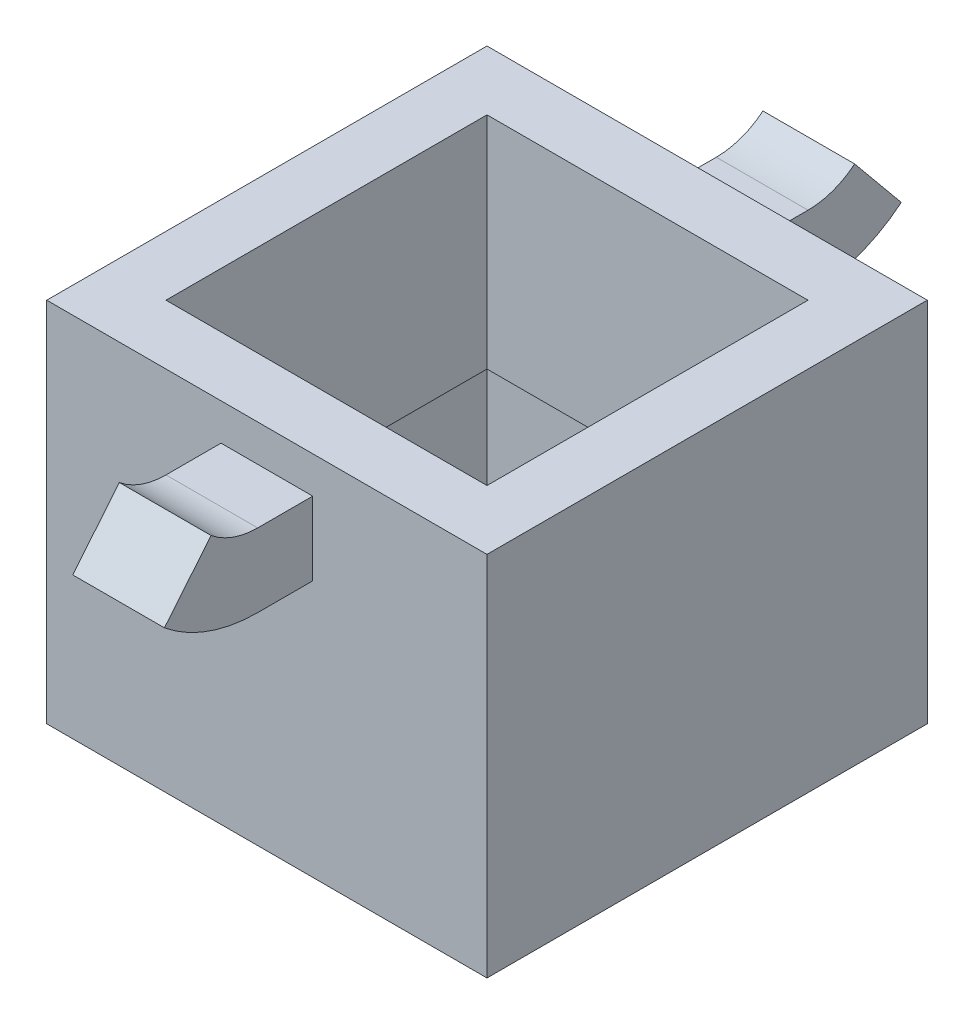
ISO-10303-21;
HEADER;
FILE_DESCRIPTION(('STEP AP214'),'2;1');
FILE_NAME('part.step','',(''),(''),'','','');
FILE_SCHEMA(('AUTOMOTIVE_DESIGN { 1 0 10303 214 1 1 1 1 }'));
ENDSEC;
DATA;
#1=APPLICATION_CONTEXT('core data for automotive mechanical design processes');
#2=APPLICATION_PROTOCOL_DEFINITION('international standard','automotive_design',2000,#1);
#3=PRODUCT_CONTEXT('',#1,'mechanical');
#4=PRODUCT('Part','Part','',(#3));
#5=PRODUCT_RELATED_PRODUCT_CATEGORY('part','',(#4));
#6=PRODUCT_DEFINITION_FORMATION('','',#4);
#7=PRODUCT_DEFINITION_CONTEXT('part definition',#1,'design');
#8=PRODUCT_DEFINITION('design','',#6,#7);
#9=PRODUCT_DEFINITION_SHAPE('','',#8);
#10=(LENGTH_UNIT() NAMED_UNIT(*) SI_UNIT(.MILLI.,.METRE.));
#11=(NAMED_UNIT(*) PLANE_ANGLE_UNIT() SI_UNIT($,.RADIAN.));
#12=(NAMED_UNIT(*) SI_UNIT($,.STERADIAN.) SOLID_ANGLE_UNIT());
#13=UNCERTAINTY_MEASURE_WITH_UNIT(LENGTH_MEASURE(1.E-05),#10,'distance_accuracy_value','');
#14=(GEOMETRIC_REPRESENTATION_CONTEXT(3) GLOBAL_UNCERTAINTY_ASSIGNED_CONTEXT((#13)) GLOBAL_UNIT_ASSIGNED_CONTEXT((#10,
#11,#12)) REPRESENTATION_CONTEXT('',''));
#15=CARTESIAN_POINT('',(0.,0.,0.));
#16=DIRECTION('',(0.,0.,1.));
#17=DIRECTION('',(1.,0.,0.));
#18=AXIS2_PLACEMENT_3D('',#15,#16,#17);
#19=CARTESIAN_POINT('',(12.,20.,-12.));
#20=DIRECTION('',(0.,0.,1.));
#21=DIRECTION('',(1.,0.,0.));
#22=AXIS2_PLACEMENT_3D('',#19,#20,#21);
#23=PLANE('',#22);
#24=DIRECTION('',(-1.,0.,0.));
#25=VECTOR('',#24,1.);
#26=CARTESIAN_POINT('',(12.,0.,-12.));
#27=LINE('',#26,#25);
#28=CARTESIAN_POINT('',(12.,0.,-12.));
#29=VERTEX_POINT('',#28);
#30=CARTESIAN_POINT('',(-12.,0.,-12.));
#31=VERTEX_POINT('',#30);
#32=EDGE_CURVE('E365',#29,#31,#27,.T.);
#33=ORIENTED_EDGE('',*,*,#32,.T.);
#34=DIRECTION('',(0.,-1.,0.));
#35=VECTOR('',#34,1.);
#36=CARTESIAN_POINT('',(-12.,20.,-12.));
#37=LINE('',#36,#35);
#38=CARTESIAN_POINT('',(-12.,20.,-12.));
#39=VERTEX_POINT('',#38);
#40=EDGE_CURVE('E371',#39,#31,#37,.T.);
#41=ORIENTED_EDGE('',*,*,#40,.F.);
#42=DIRECTION('',(-1.,0.,0.));
#43=VECTOR('',#42,1.);
#44=CARTESIAN_POINT('',(12.,20.,-12.));
#45=LINE('',#44,#43);
#46=CARTESIAN_POINT('',(12.,20.,-12.));
#47=VERTEX_POINT('',#46);
#48=EDGE_CURVE('E369',#47,#39,#45,.T.);
#49=ORIENTED_EDGE('',*,*,#48,.F.);
#50=DIRECTION('',(0.,-1.,0.));
#51=VECTOR('',#50,1.);
#52=CARTESIAN_POINT('',(12.,20.,-12.));
#53=LINE('',#52,#51);
#54=EDGE_CURVE('E381',#47,#29,#53,.T.);
#55=ORIENTED_EDGE('',*,*,#54,.T.);
#56=EDGE_LOOP('',(#33,#41,#49,#55));
#57=FACE_BOUND('',#56,.T.);
#58=DIRECTION('',(0.,-1.,0.));
#59=VECTOR('',#58,1.);
#60=CARTESIAN_POINT('',(2.50000000000001,18.,-12.));
#61=LINE('',#60,#59);
#62=CARTESIAN_POINT('',(2.50000000000001,18.,-12.));
#63=VERTEX_POINT('',#62);
#64=CARTESIAN_POINT('',(2.50000000000001,14.,-12.));
#65=VERTEX_POINT('',#64);
#66=EDGE_CURVE('E306',#63,#65,#61,.T.);
#67=ORIENTED_EDGE('',*,*,#66,.F.);
#68=DIRECTION('',(1.,0.,0.));
#69=VECTOR('',#68,1.);
#70=CARTESIAN_POINT('',(-2.49999999999999,18.,-12.));
#71=LINE('',#70,#69);
#72=CARTESIAN_POINT('',(-2.5,18.,-12.));
#73=VERTEX_POINT('',#72);
#74=EDGE_CURVE('E311',#73,#63,#71,.T.);
#75=ORIENTED_EDGE('',*,*,#74,.F.);
#76=DIRECTION('',(0.,1.,0.));
#77=VECTOR('',#76,1.);
#78=CARTESIAN_POINT('',(-2.49999999999999,18.,-12.));
#79=LINE('',#78,#77);
#80=CARTESIAN_POINT('',(-2.5,14.,-12.));
#81=VERTEX_POINT('',#80);
#82=EDGE_CURVE('E320',#81,#73,#79,.T.);
#83=ORIENTED_EDGE('',*,*,#82,.F.);
#84=DIRECTION('',(-1.,0.,0.));
#85=VECTOR('',#84,1.);
#86=CARTESIAN_POINT('',(-2.49999999999999,14.,-12.));
#87=LINE('',#86,#85);
#88=EDGE_CURVE('E317',#65,#81,#87,.T.);
#89=ORIENTED_EDGE('',*,*,#88,.F.);
#90=EDGE_LOOP('',(#67,#75,#83,#89));
#91=FACE_BOUND('',#90,.T.);
#92=ADVANCED_FACE('F32',(#57,#91),#23,.F.);
#93=CARTESIAN_POINT('',(-12.,20.,12.));
#94=DIRECTION('',(1.,0.,0.));
#95=DIRECTION('',(0.,0.,-1.));
#96=AXIS2_PLACEMENT_3D('',#93,#94,#95);
#97=PLANE('',#96);
#98=DIRECTION('',(0.,0.,1.));
#99=VECTOR('',#98,1.);
#100=CARTESIAN_POINT('',(-12.,0.,12.));
#101=LINE('',#100,#99);
#102=CARTESIAN_POINT('',(-12.,0.,12.));
#103=VERTEX_POINT('',#102);
#104=EDGE_CURVE('E360',#31,#103,#101,.T.);
#105=ORIENTED_EDGE('',*,*,#104,.T.);
#106=DIRECTION('',(0.,-1.,0.));
#107=VECTOR('',#106,1.);
#108=CARTESIAN_POINT('',(-12.,20.,12.));
#109=LINE('',#108,#107);
#110=CARTESIAN_POINT('',(-12.,20.,12.));
#111=VERTEX_POINT('',#110);
#112=EDGE_CURVE('E11',#111,#103,#109,.T.);
#113=ORIENTED_EDGE('',*,*,#112,.F.);
#114=DIRECTION('',(0.,0.,1.));
#115=VECTOR('',#114,1.);
#116=CARTESIAN_POINT('',(-12.,20.,12.));
#117=LINE('',#116,#115);
#118=EDGE_CURVE('E361',#39,#111,#117,.T.);
#119=ORIENTED_EDGE('',*,*,#118,.F.);
#120=ORIENTED_EDGE('',*,*,#40,.T.);
#121=EDGE_LOOP('',(#105,#113,#119,#120));
#122=FACE_BOUND('',#121,.T.);
#123=ADVANCED_FACE('F34',(#122),#97,.F.);
#124=CARTESIAN_POINT('',(12.,20.,12.));
#125=DIRECTION('',(0.,0.,-1.));
#126=DIRECTION('',(-1.,0.,0.));
#127=AXIS2_PLACEMENT_3D('',#124,#125,#126);
#128=PLANE('',#127);
#129=DIRECTION('',(1.,0.,0.));
#130=VECTOR('',#129,1.);
#131=CARTESIAN_POINT('',(-2.49999999999999,18.,12.));
#132=LINE('',#131,#130);
#133=CARTESIAN_POINT('',(-2.49999999999999,18.,12.));
#134=VERTEX_POINT('',#133);
#135=CARTESIAN_POINT('',(2.50000000000001,18.,12.));
#136=VERTEX_POINT('',#135);
#137=EDGE_CURVE('E270',#134,#136,#132,.T.);
#138=ORIENTED_EDGE('',*,*,#137,.T.);
#139=DIRECTION('',(0.,-1.,0.));
#140=VECTOR('',#139,1.);
#141=CARTESIAN_POINT('',(2.50000000000001,18.,12.));
#142=LINE('',#141,#140);
#143=CARTESIAN_POINT('',(2.5,14.,12.));
#144=VERTEX_POINT('',#143);
#145=EDGE_CURVE('E253',#136,#144,#142,.T.);
#146=ORIENTED_EDGE('',*,*,#145,.T.);
#147=DIRECTION('',(-1.,0.,0.));
#148=VECTOR('',#147,1.);
#149=CARTESIAN_POINT('',(-2.49999999999999,14.,12.));
#150=LINE('',#149,#148);
#151=CARTESIAN_POINT('',(-2.5,14.,12.));
#152=VERTEX_POINT('',#151);
#153=EDGE_CURVE('E264',#144,#152,#150,.T.);
#154=ORIENTED_EDGE('',*,*,#153,.T.);
#155=DIRECTION('',(0.,1.,0.));
#156=VECTOR('',#155,1.);
#157=CARTESIAN_POINT('',(-2.49999999999999,18.,12.));
#158=LINE('',#157,#156);
#159=EDGE_CURVE('E273',#152,#134,#158,.T.);
#160=ORIENTED_EDGE('',*,*,#159,.T.);
#161=EDGE_LOOP('',(#138,#146,#154,#160));
#162=FACE_BOUND('',#161,.T.);
#163=DIRECTION('',(1.,0.,0.));
#164=VECTOR('',#163,1.);
#165=CARTESIAN_POINT('',(12.,0.,12.));
#166=LINE('',#165,#164);
#167=CARTESIAN_POINT('',(12.,0.,12.));
#168=VERTEX_POINT('',#167);
#169=EDGE_CURVE('E374',#103,#168,#166,.T.);
#170=ORIENTED_EDGE('',*,*,#169,.T.);
#171=DIRECTION('',(0.,-1.,0.));
#172=VECTOR('',#171,1.);
#173=CARTESIAN_POINT('',(12.,20.,12.));
#174=LINE('',#173,#172);
#175=CARTESIAN_POINT('',(12.,20.,12.));
#176=VERTEX_POINT('',#175);
#177=EDGE_CURVE('E40',#176,#168,#174,.T.);
#178=ORIENTED_EDGE('',*,*,#177,.F.);
#179=DIRECTION('',(1.,0.,0.));
#180=VECTOR('',#179,1.);
#181=CARTESIAN_POINT('',(12.,20.,12.));
#182=LINE('',#181,#180);
#183=EDGE_CURVE('E364',#111,#176,#182,.T.);
#184=ORIENTED_EDGE('',*,*,#183,.F.);
#185=ORIENTED_EDGE('',*,*,#112,.T.);
#186=EDGE_LOOP('',(#170,#178,#184,#185));
#187=FACE_BOUND('',#186,.T.);
#188=ADVANCED_FACE('F402',(#162,#187),#128,.F.);
#189=CARTESIAN_POINT('',(12.,20.,12.));
#190=DIRECTION('',(-1.,0.,0.));
#191=DIRECTION('',(0.,0.,1.));
#192=AXIS2_PLACEMENT_3D('',#189,#190,#191);
#193=PLANE('',#192);
#194=DIRECTION('',(0.,0.,-1.));
#195=VECTOR('',#194,1.);
#196=CARTESIAN_POINT('',(12.,0.,12.));
#197=LINE('',#196,#195);
#198=EDGE_CURVE('E376',#168,#29,#197,.T.);
#199=ORIENTED_EDGE('',*,*,#198,.T.);
#200=ORIENTED_EDGE('',*,*,#54,.F.);
#201=DIRECTION('',(0.,0.,-1.));
#202=VECTOR('',#201,1.);
#203=CARTESIAN_POINT('',(12.,20.,12.));
#204=LINE('',#203,#202);
#205=EDGE_CURVE('E367',#176,#47,#204,.T.);
#206=ORIENTED_EDGE('',*,*,#205,.F.);
#207=ORIENTED_EDGE('',*,*,#177,.T.);
#208=EDGE_LOOP('',(#199,#200,#206,#207));
#209=FACE_BOUND('',#208,.T.);
#210=ADVANCED_FACE('F388',(#209),#193,.F.);
#211=CARTESIAN_POINT('',(0.,20.,0.));
#212=DIRECTION('',(0.,1.,0.));
#213=DIRECTION('',(0.,0.,1.));
#214=AXIS2_PLACEMENT_3D('',#211,#212,#213);
#215=PLANE('',#214);
#216=DIRECTION('',(0.,0.,-1.));
#217=VECTOR('',#216,1.);
#218=CARTESIAN_POINT('',(-8.75,20.,-8.75));
#219=LINE('',#218,#217);
#220=CARTESIAN_POINT('',(-8.75,20.,8.75));
#221=VERTEX_POINT('',#220);
#222=CARTESIAN_POINT('',(-8.75,20.,-8.75));
#223=VERTEX_POINT('',#222);
#224=EDGE_CURVE('E203',#221,#223,#219,.T.);
#225=ORIENTED_EDGE('',*,*,#224,.T.);
#226=DIRECTION('',(1.,0.,0.));
#227=VECTOR('',#226,1.);
#228=CARTESIAN_POINT('',(8.75,20.,-8.75));
#229=LINE('',#228,#227);
#230=CARTESIAN_POINT('',(8.75,20.,-8.75));
#231=VERTEX_POINT('',#230);
#232=EDGE_CURVE('E192',#223,#231,#229,.T.);
#233=ORIENTED_EDGE('',*,*,#232,.T.);
#234=DIRECTION('',(0.,0.,1.));
#235=VECTOR('',#234,1.);
#236=CARTESIAN_POINT('',(8.75,20.,-8.75));
#237=LINE('',#236,#235);
#238=CARTESIAN_POINT('',(8.75,20.,8.75));
#239=VERTEX_POINT('',#238);
#240=EDGE_CURVE('E214',#231,#239,#237,.T.);
#241=ORIENTED_EDGE('',*,*,#240,.T.);
#242=DIRECTION('',(-1.,0.,0.));
#243=VECTOR('',#242,1.);
#244=CARTESIAN_POINT('',(8.75,20.,8.75));
#245=LINE('',#244,#243);
#246=EDGE_CURVE('E210',#239,#221,#245,.T.);
#247=ORIENTED_EDGE('',*,*,#246,.T.);
#248=EDGE_LOOP('',(#225,#233,#241,#247));
#249=FACE_BOUND('',#248,.T.);
#250=ORIENTED_EDGE('',*,*,#118,.T.);
#251=ORIENTED_EDGE('',*,*,#183,.T.);
#252=ORIENTED_EDGE('',*,*,#205,.T.);
#253=ORIENTED_EDGE('',*,*,#48,.T.);
#254=EDGE_LOOP('',(#250,#251,#252,#253));
#255=FACE_BOUND('',#254,.T.);
#256=ADVANCED_FACE('F208',(#249,#255),#215,.T.);
#257=CARTESIAN_POINT('',(0.,0.,0.));
#258=DIRECTION('',(0.,1.,0.));
#259=DIRECTION('',(0.,0.,1.));
#260=AXIS2_PLACEMENT_3D('',#257,#258,#259);
#261=PLANE('',#260);
#262=DIRECTION('',(-1.,0.,0.));
#263=VECTOR('',#262,1.);
#264=CARTESIAN_POINT('',(-10.,0.,10.));
#265=LINE('',#264,#263);
#266=CARTESIAN_POINT('',(10.,0.,10.));
#267=VERTEX_POINT('',#266);
#268=CARTESIAN_POINT('',(-10.,0.,10.));
#269=VERTEX_POINT('',#268);
#270=EDGE_CURVE('E241',#267,#269,#265,.T.);
#271=ORIENTED_EDGE('',*,*,#270,.F.);
#272=DIRECTION('',(0.,0.,1.));
#273=VECTOR('',#272,1.);
#274=CARTESIAN_POINT('',(10.,0.,-10.));
#275=LINE('',#274,#273);
#276=CARTESIAN_POINT('',(10.,0.,-10.));
#277=VERTEX_POINT('',#276);
#278=EDGE_CURVE('E239',#277,#267,#275,.T.);
#279=ORIENTED_EDGE('',*,*,#278,.F.);
#280=DIRECTION('',(1.,0.,0.));
#281=VECTOR('',#280,1.);
#282=CARTESIAN_POINT('',(-10.,0.,-10.));
#283=LINE('',#282,#281);
#284=CARTESIAN_POINT('',(-10.,0.,-10.));
#285=VERTEX_POINT('',#284);
#286=EDGE_CURVE('E247',#285,#277,#283,.T.);
#287=ORIENTED_EDGE('',*,*,#286,.F.);
#288=DIRECTION('',(0.,0.,-1.));
#289=VECTOR('',#288,1.);
#290=CARTESIAN_POINT('',(-10.,0.,-10.));
#291=LINE('',#290,#289);
#292=EDGE_CURVE('E244',#269,#285,#291,.T.);
#293=ORIENTED_EDGE('',*,*,#292,.F.);
#294=EDGE_LOOP('',(#271,#279,#287,#293));
#295=FACE_BOUND('',#294,.T.);
#296=ORIENTED_EDGE('',*,*,#104,.F.);
#297=ORIENTED_EDGE('',*,*,#32,.F.);
#298=ORIENTED_EDGE('',*,*,#198,.F.);
#299=ORIENTED_EDGE('',*,*,#169,.F.);
#300=EDGE_LOOP('',(#296,#297,#298,#299));
#301=FACE_BOUND('',#300,.T.);
#302=ADVANCED_FACE('F394',(#295,#301),#261,.F.);
#303=CARTESIAN_POINT('',(0.,22.,-15.));
#304=DIRECTION('',(1.,0.,0.));
#305=DIRECTION('',(0.,0.,-1.));
#306=AXIS2_PLACEMENT_3D('',#303,#304,#305);
#307=CYLINDRICAL_SURFACE('',#306,8.);
#308=DIRECTION('',(-1.,0.,0.));
#309=VECTOR('',#308,1.);
#310=CARTESIAN_POINT('',(-2.49999999999999,14.,-15.));
#311=LINE('',#310,#309);
#312=CARTESIAN_POINT('',(2.5,14.,-15.));
#313=VERTEX_POINT('',#312);
#314=CARTESIAN_POINT('',(-2.49999999999999,14.,-15.));
#315=VERTEX_POINT('',#314);
#316=EDGE_CURVE('E307',#313,#315,#311,.T.);
#317=ORIENTED_EDGE('',*,*,#316,.T.);
#318=CARTESIAN_POINT('',(-2.49999999999999,22.,-15.));
#319=DIRECTION('',(1.,0.,0.));
#320=DIRECTION('',(0.,0.,-1.));
#321=AXIS2_PLACEMENT_3D('',#318,#319,#320);
#322=CIRCLE('',#321,8.);
#323=CARTESIAN_POINT('',(-2.49999999999999,15.8236304445881,-20.0845313564753));
#324=VERTEX_POINT('',#323);
#325=EDGE_CURVE('E354',#315,#324,#322,.T.);
#326=ORIENTED_EDGE('',*,*,#325,.T.);
#327=DIRECTION('',(-1.,0.,0.));
#328=VECTOR('',#327,1.);
#329=CARTESIAN_POINT('',(-2.49999999999999,15.8236304445881,-20.0845313564753));
#330=LINE('',#329,#328);
#331=CARTESIAN_POINT('',(2.5,15.8236304445881,-20.0845313564753));
#332=VERTEX_POINT('',#331);
#333=EDGE_CURVE('E345',#332,#324,#330,.T.);
#334=ORIENTED_EDGE('',*,*,#333,.F.);
#335=CARTESIAN_POINT('',(2.5,22.,-15.));
#336=DIRECTION('',(1.,0.,0.));
#337=DIRECTION('',(0.,0.,-1.));
#338=AXIS2_PLACEMENT_3D('',#335,#336,#337);
#339=CIRCLE('',#338,8.);
#340=EDGE_CURVE('E357',#313,#332,#339,.T.);
#341=ORIENTED_EDGE('',*,*,#340,.F.);
#342=EDGE_LOOP('',(#317,#326,#334,#341));
#343=FACE_BOUND('',#342,.T.);
#344=ADVANCED_FACE('F417',(#343),#307,.T.);
#345=CARTESIAN_POINT('',(0.,22.,-15.));
#346=DIRECTION('',(1.,0.,0.));
#347=DIRECTION('',(0.,0.,-1.));
#348=AXIS2_PLACEMENT_3D('',#345,#346,#347);
#349=CYLINDRICAL_SURFACE('',#348,4.);
#350=DIRECTION('',(1.,0.,0.));
#351=VECTOR('',#350,1.);
#352=CARTESIAN_POINT('',(-2.49999999999999,18.,-15.));
#353=LINE('',#352,#351);
#354=CARTESIAN_POINT('',(-2.49999999999999,18.,-15.));
#355=VERTEX_POINT('',#354);
#356=CARTESIAN_POINT('',(2.50000000000001,18.,-15.));
#357=VERTEX_POINT('',#356);
#358=EDGE_CURVE('E310',#355,#357,#353,.T.);
#359=ORIENTED_EDGE('',*,*,#358,.T.);
#360=CARTESIAN_POINT('',(2.50000000000001,22.,-15.));
#361=DIRECTION('',(1.,0.,0.));
#362=DIRECTION('',(0.,0.,-1.));
#363=AXIS2_PLACEMENT_3D('',#360,#361,#362);
#364=CIRCLE('',#363,4.);
#365=CARTESIAN_POINT('',(2.50000000000001,18.911815222294,-17.5422656782377));
#366=VERTEX_POINT('',#365);
#367=EDGE_CURVE('E348',#357,#366,#364,.T.);
#368=ORIENTED_EDGE('',*,*,#367,.T.);
#369=DIRECTION('',(1.,0.,0.));
#370=VECTOR('',#369,1.);
#371=CARTESIAN_POINT('',(-2.49999999999999,18.911815222294,-17.5422656782377));
#372=LINE('',#371,#370);
#373=CARTESIAN_POINT('',(-2.49999999999999,18.911815222294,-17.5422656782377));
#374=VERTEX_POINT('',#373);
#375=EDGE_CURVE('E339',#374,#366,#372,.T.);
#376=ORIENTED_EDGE('',*,*,#375,.F.);
#377=CARTESIAN_POINT('',(-2.49999999999999,22.,-15.));
#378=DIRECTION('',(1.,0.,0.));
#379=DIRECTION('',(0.,0.,-1.));
#380=AXIS2_PLACEMENT_3D('',#377,#378,#379);
#381=CIRCLE('',#380,4.);
#382=EDGE_CURVE('E351',#355,#374,#381,.T.);
#383=ORIENTED_EDGE('',*,*,#382,.F.);
#384=EDGE_LOOP('',(#359,#368,#376,#383));
#385=FACE_BOUND('',#384,.T.);
#386=ADVANCED_FACE('F423',(#385),#349,.F.);
#387=CARTESIAN_POINT('',(2.50000000000001,18.,-15.));
#388=DIRECTION('',(-1.,0.,0.));
#389=DIRECTION('',(0.,-1.,0.));
#390=AXIS2_PLACEMENT_3D('',#387,#388,#389);
#391=PLANE('',#390);
#392=ORIENTED_EDGE('',*,*,#66,.T.);
#393=DIRECTION('',(0.,0.,1.));
#394=VECTOR('',#393,1.);
#395=CARTESIAN_POINT('',(2.5,14.,-15.));
#396=LINE('',#395,#394);
#397=EDGE_CURVE('E333',#313,#65,#396,.T.);
#398=ORIENTED_EDGE('',*,*,#397,.F.);
#399=ORIENTED_EDGE('',*,*,#340,.T.);
#400=DIRECTION('',(0.,-0.77204619442649,-0.635566419559415));
#401=VECTOR('',#400,1.);
#402=CARTESIAN_POINT('',(2.50000000000001,18.911815222294,-17.5422656782377));
#403=LINE('',#402,#401);
#404=EDGE_CURVE('E336',#366,#332,#403,.T.);
#405=ORIENTED_EDGE('',*,*,#404,.F.);
#406=ORIENTED_EDGE('',*,*,#367,.F.);
#407=DIRECTION('',(0.,0.,1.));
#408=VECTOR('',#407,1.);
#409=CARTESIAN_POINT('',(2.50000000000001,18.,-15.));
#410=LINE('',#409,#408);
#411=EDGE_CURVE('E314',#357,#63,#410,.T.);
#412=ORIENTED_EDGE('',*,*,#411,.T.);
#413=EDGE_LOOP('',(#392,#398,#399,#405,#406,#412));
#414=FACE_BOUND('',#413,.T.);
#415=ADVANCED_FACE('F427',(#414),#391,.F.);
#416=CARTESIAN_POINT('',(-2.49999999999999,14.,-15.));
#417=DIRECTION('',(0.,1.,0.));
#418=DIRECTION('',(0.,0.,1.));
#419=AXIS2_PLACEMENT_3D('',#416,#417,#418);
#420=PLANE('',#419);
#421=ORIENTED_EDGE('',*,*,#88,.T.);
#422=DIRECTION('',(0.,0.,1.));
#423=VECTOR('',#422,1.);
#424=CARTESIAN_POINT('',(-2.49999999999999,14.,-15.));
#425=LINE('',#424,#423);
#426=EDGE_CURVE('E330',#315,#81,#425,.T.);
#427=ORIENTED_EDGE('',*,*,#426,.F.);
#428=ORIENTED_EDGE('',*,*,#316,.F.);
#429=ORIENTED_EDGE('',*,*,#397,.T.);
#430=EDGE_LOOP('',(#421,#427,#428,#429));
#431=FACE_BOUND('',#430,.T.);
#432=ADVANCED_FACE('F431',(#431),#420,.F.);
#433=CARTESIAN_POINT('',(-2.49999999999999,18.,-15.));
#434=DIRECTION('',(1.,0.,0.));
#435=DIRECTION('',(0.,0.,-1.));
#436=AXIS2_PLACEMENT_3D('',#433,#434,#435);
#437=PLANE('',#436);
#438=ORIENTED_EDGE('',*,*,#82,.T.);
#439=DIRECTION('',(0.,0.,1.));
#440=VECTOR('',#439,1.);
#441=CARTESIAN_POINT('',(-2.49999999999999,18.,-15.));
#442=LINE('',#441,#440);
#443=EDGE_CURVE('E327',#355,#73,#442,.T.);
#444=ORIENTED_EDGE('',*,*,#443,.F.);
#445=ORIENTED_EDGE('',*,*,#382,.T.);
#446=DIRECTION('',(0.,0.77204619442649,0.635566419559415));
#447=VECTOR('',#446,1.);
#448=CARTESIAN_POINT('',(-2.49999999999999,18.911815222294,-17.5422656782377));
#449=LINE('',#448,#447);
#450=EDGE_CURVE('E342',#324,#374,#449,.T.);
#451=ORIENTED_EDGE('',*,*,#450,.F.);
#452=ORIENTED_EDGE('',*,*,#325,.F.);
#453=ORIENTED_EDGE('',*,*,#426,.T.);
#454=EDGE_LOOP('',(#438,#444,#445,#451,#452,#453));
#455=FACE_BOUND('',#454,.T.);
#456=ADVANCED_FACE('F435',(#455),#437,.F.);
#457=CARTESIAN_POINT('',(-2.49999999999999,18.,-15.));
#458=DIRECTION('',(0.,-1.,0.));
#459=DIRECTION('',(0.,0.,-1.));
#460=AXIS2_PLACEMENT_3D('',#457,#458,#459);
#461=PLANE('',#460);
#462=ORIENTED_EDGE('',*,*,#74,.T.);
#463=ORIENTED_EDGE('',*,*,#411,.F.);
#464=ORIENTED_EDGE('',*,*,#358,.F.);
#465=ORIENTED_EDGE('',*,*,#443,.T.);
#466=EDGE_LOOP('',(#462,#463,#464,#465));
#467=FACE_BOUND('',#466,.T.);
#468=ADVANCED_FACE('F439',(#467),#461,.F.);
#469=CARTESIAN_POINT('',(0.,5.01498372261722,-28.9824612303071));
#470=DIRECTION('',(0.,-0.635566419559415,0.77204619442649));
#471=DIRECTION('',(1.,0.,0.));
#472=AXIS2_PLACEMENT_3D('',#469,#470,#471);
#473=PLANE('',#472);
#474=ORIENTED_EDGE('',*,*,#404,.T.);
#475=ORIENTED_EDGE('',*,*,#333,.T.);
#476=ORIENTED_EDGE('',*,*,#450,.T.);
#477=ORIENTED_EDGE('',*,*,#375,.T.);
#478=EDGE_LOOP('',(#474,#475,#476,#477));
#479=FACE_BOUND('',#478,.T.);
#480=ADVANCED_FACE('F443',(#479),#473,.F.);
#481=CARTESIAN_POINT('',(0.,22.,15.));
#482=DIRECTION('',(-1.,0.,0.));
#483=DIRECTION('',(0.,0.,1.));
#484=AXIS2_PLACEMENT_3D('',#481,#482,#483);
#485=CYLINDRICAL_SURFACE('',#484,4.);
#486=DIRECTION('',(1.,0.,0.));
#487=VECTOR('',#486,1.);
#488=CARTESIAN_POINT('',(-2.49999999999999,18.,15.));
#489=LINE('',#488,#487);
#490=CARTESIAN_POINT('',(-2.49999999999999,18.,15.));
#491=VERTEX_POINT('',#490);
#492=CARTESIAN_POINT('',(2.50000000000001,18.,15.));
#493=VERTEX_POINT('',#492);
#494=EDGE_CURVE('E260',#491,#493,#489,.T.);
#495=ORIENTED_EDGE('',*,*,#494,.F.);
#496=CARTESIAN_POINT('',(-2.49999999999999,22.,15.));
#497=DIRECTION('',(-1.,0.,0.));
#498=DIRECTION('',(0.,0.,1.));
#499=AXIS2_PLACEMENT_3D('',#496,#497,#498);
#500=CIRCLE('',#499,4.);
#501=CARTESIAN_POINT('',(-2.49999999999999,18.911815222294,17.5422656782377));
#502=VERTEX_POINT('',#501);
#503=EDGE_CURVE('E300',#491,#502,#500,.T.);
#504=ORIENTED_EDGE('',*,*,#503,.T.);
#505=DIRECTION('',(1.,0.,0.));
#506=VECTOR('',#505,1.);
#507=CARTESIAN_POINT('',(-2.49999999999999,18.911815222294,17.5422656782377));
#508=LINE('',#507,#506);
#509=CARTESIAN_POINT('',(2.50000000000001,18.911815222294,17.5422656782377));
#510=VERTEX_POINT('',#509);
#511=EDGE_CURVE('E292',#502,#510,#508,.T.);
#512=ORIENTED_EDGE('',*,*,#511,.T.);
#513=CARTESIAN_POINT('',(2.50000000000001,22.,15.));
#514=DIRECTION('',(-1.,0.,0.));
#515=DIRECTION('',(0.,0.,1.));
#516=AXIS2_PLACEMENT_3D('',#513,#514,#515);
#517=CIRCLE('',#516,4.);
#518=EDGE_CURVE('E303',#493,#510,#517,.T.);
#519=ORIENTED_EDGE('',*,*,#518,.F.);
#520=EDGE_LOOP('',(#495,#504,#512,#519));
#521=FACE_BOUND('',#520,.T.);
#522=ADVANCED_FACE('F447',(#521),#485,.F.);
#523=CARTESIAN_POINT('',(0.,22.,15.));
#524=DIRECTION('',(-1.,0.,0.));
#525=DIRECTION('',(0.,0.,1.));
#526=AXIS2_PLACEMENT_3D('',#523,#524,#525);
#527=CYLINDRICAL_SURFACE('',#526,8.);
#528=DIRECTION('',(-1.,0.,0.));
#529=VECTOR('',#528,1.);
#530=CARTESIAN_POINT('',(-2.49999999999999,14.,15.));
#531=LINE('',#530,#529);
#532=CARTESIAN_POINT('',(2.5,14.,15.));
#533=VERTEX_POINT('',#532);
#534=CARTESIAN_POINT('',(-2.49999999999999,14.,15.));
#535=VERTEX_POINT('',#534);
#536=EDGE_CURVE('E263',#533,#535,#531,.T.);
#537=ORIENTED_EDGE('',*,*,#536,.F.);
#538=CARTESIAN_POINT('',(2.5,22.,15.));
#539=DIRECTION('',(-1.,0.,0.));
#540=DIRECTION('',(0.,0.,1.));
#541=AXIS2_PLACEMENT_3D('',#538,#539,#540);
#542=CIRCLE('',#541,8.);
#543=CARTESIAN_POINT('',(2.5,15.8236304445881,20.0845313564753));
#544=VERTEX_POINT('',#543);
#545=EDGE_CURVE('E294',#533,#544,#542,.T.);
#546=ORIENTED_EDGE('',*,*,#545,.T.);
#547=DIRECTION('',(-1.,0.,0.));
#548=VECTOR('',#547,1.);
#549=CARTESIAN_POINT('',(-2.49999999999999,15.8236304445881,20.0845313564753));
#550=LINE('',#549,#548);
#551=CARTESIAN_POINT('',(-2.49999999999999,15.8236304445881,20.0845313564753));
#552=VERTEX_POINT('',#551);
#553=EDGE_CURVE('E288',#544,#552,#550,.T.);
#554=ORIENTED_EDGE('',*,*,#553,.T.);
#555=CARTESIAN_POINT('',(-2.49999999999999,22.,15.));
#556=DIRECTION('',(-1.,0.,0.));
#557=DIRECTION('',(0.,0.,1.));
#558=AXIS2_PLACEMENT_3D('',#555,#556,#557);
#559=CIRCLE('',#558,8.);
#560=EDGE_CURVE('E297',#535,#552,#559,.T.);
#561=ORIENTED_EDGE('',*,*,#560,.F.);
#562=EDGE_LOOP('',(#537,#546,#554,#561));
#563=FACE_BOUND('',#562,.T.);
#564=ADVANCED_FACE('F451',(#563),#527,.T.);
#565=CARTESIAN_POINT('',(2.50000000000001,18.,15.));
#566=DIRECTION('',(1.,0.,0.));
#567=DIRECTION('',(0.,1.,0.));
#568=AXIS2_PLACEMENT_3D('',#565,#566,#567);
#569=PLANE('',#568);
#570=ORIENTED_EDGE('',*,*,#145,.F.);
#571=DIRECTION('',(0.,0.,-1.));
#572=VECTOR('',#571,1.);
#573=CARTESIAN_POINT('',(2.50000000000001,18.,15.));
#574=LINE('',#573,#572);
#575=EDGE_CURVE('E284',#493,#136,#574,.T.);
#576=ORIENTED_EDGE('',*,*,#575,.F.);
#577=ORIENTED_EDGE('',*,*,#518,.T.);
#578=DIRECTION('',(0.,-0.77204619442649,0.635566419559415));
#579=VECTOR('',#578,1.);
#580=CARTESIAN_POINT('',(2.50000000000001,18.911815222294,17.5422656782377));
#581=LINE('',#580,#579);
#582=EDGE_CURVE('E286',#510,#544,#581,.T.);
#583=ORIENTED_EDGE('',*,*,#582,.T.);
#584=ORIENTED_EDGE('',*,*,#545,.F.);
#585=DIRECTION('',(0.,0.,-1.));
#586=VECTOR('',#585,1.);
#587=CARTESIAN_POINT('',(2.5,14.,15.));
#588=LINE('',#587,#586);
#589=EDGE_CURVE('E267',#533,#144,#588,.T.);
#590=ORIENTED_EDGE('',*,*,#589,.T.);
#591=EDGE_LOOP('',(#570,#576,#577,#583,#584,#590));
#592=FACE_BOUND('',#591,.T.);
#593=ADVANCED_FACE('F455',(#592),#569,.T.);
#594=CARTESIAN_POINT('',(-2.49999999999999,18.,15.));
#595=DIRECTION('',(0.,1.,0.));
#596=DIRECTION('',(0.,0.,1.));
#597=AXIS2_PLACEMENT_3D('',#594,#595,#596);
#598=PLANE('',#597);
#599=ORIENTED_EDGE('',*,*,#137,.F.);
#600=DIRECTION('',(0.,0.,-1.));
#601=VECTOR('',#600,1.);
#602=CARTESIAN_POINT('',(-2.49999999999999,18.,15.));
#603=LINE('',#602,#601);
#604=EDGE_CURVE('E282',#491,#134,#603,.T.);
#605=ORIENTED_EDGE('',*,*,#604,.F.);
#606=ORIENTED_EDGE('',*,*,#494,.T.);
#607=ORIENTED_EDGE('',*,*,#575,.T.);
#608=EDGE_LOOP('',(#599,#605,#606,#607));
#609=FACE_BOUND('',#608,.T.);
#610=ADVANCED_FACE('F459',(#609),#598,.T.);
#611=CARTESIAN_POINT('',(-2.49999999999999,18.,15.));
#612=DIRECTION('',(-1.,0.,0.));
#613=DIRECTION('',(0.,0.,1.));
#614=AXIS2_PLACEMENT_3D('',#611,#612,#613);
#615=PLANE('',#614);
#616=ORIENTED_EDGE('',*,*,#159,.F.);
#617=DIRECTION('',(0.,0.,-1.));
#618=VECTOR('',#617,1.);
#619=CARTESIAN_POINT('',(-2.49999999999999,14.,15.));
#620=LINE('',#619,#618);
#621=EDGE_CURVE('E279',#535,#152,#620,.T.);
#622=ORIENTED_EDGE('',*,*,#621,.F.);
#623=ORIENTED_EDGE('',*,*,#560,.T.);
#624=DIRECTION('',(0.,0.77204619442649,-0.635566419559415));
#625=VECTOR('',#624,1.);
#626=CARTESIAN_POINT('',(-2.49999999999999,18.911815222294,17.5422656782377));
#627=LINE('',#626,#625);
#628=EDGE_CURVE('E290',#552,#502,#627,.T.);
#629=ORIENTED_EDGE('',*,*,#628,.T.);
#630=ORIENTED_EDGE('',*,*,#503,.F.);
#631=ORIENTED_EDGE('',*,*,#604,.T.);
#632=EDGE_LOOP('',(#616,#622,#623,#629,#630,#631));
#633=FACE_BOUND('',#632,.T.);
#634=ADVANCED_FACE('F463',(#633),#615,.T.);
#635=CARTESIAN_POINT('',(-2.49999999999999,14.,15.));
#636=DIRECTION('',(0.,-1.,0.));
#637=DIRECTION('',(0.,0.,-1.));
#638=AXIS2_PLACEMENT_3D('',#635,#636,#637);
#639=PLANE('',#638);
#640=ORIENTED_EDGE('',*,*,#153,.F.);
#641=ORIENTED_EDGE('',*,*,#589,.F.);
#642=ORIENTED_EDGE('',*,*,#536,.T.);
#643=ORIENTED_EDGE('',*,*,#621,.T.);
#644=EDGE_LOOP('',(#640,#641,#642,#643));
#645=FACE_BOUND('',#644,.T.);
#646=ADVANCED_FACE('F467',(#645),#639,.T.);
#647=CARTESIAN_POINT('',(0.,5.01498372261722,28.9824612303071));
#648=DIRECTION('',(0.,-0.635566419559415,-0.77204619442649));
#649=DIRECTION('',(1.,0.,0.));
#650=AXIS2_PLACEMENT_3D('',#647,#648,#649);
#651=PLANE('',#650);
#652=ORIENTED_EDGE('',*,*,#582,.F.);
#653=ORIENTED_EDGE('',*,*,#511,.F.);
#654=ORIENTED_EDGE('',*,*,#628,.F.);
#655=ORIENTED_EDGE('',*,*,#553,.F.);
#656=EDGE_LOOP('',(#652,#653,#654,#655));
#657=FACE_BOUND('',#656,.T.);
#658=ADVANCED_FACE('F471',(#657),#651,.F.);
#659=CARTESIAN_POINT('',(10.,6.,-10.));
#660=DIRECTION('',(1.,0.,0.));
#661=DIRECTION('',(0.,0.,-1.));
#662=AXIS2_PLACEMENT_3D('',#659,#660,#661);
#663=PLANE('',#662);
#664=ORIENTED_EDGE('',*,*,#278,.T.);
#665=DIRECTION('',(0.,-1.,0.));
#666=VECTOR('',#665,1.);
#667=CARTESIAN_POINT('',(10.,6.,10.));
#668=LINE('',#667,#666);
#669=CARTESIAN_POINT('',(10.,8.,10.));
#670=VERTEX_POINT('',#669);
#671=EDGE_CURVE('E250',#670,#267,#668,.T.);
#672=ORIENTED_EDGE('',*,*,#671,.F.);
#673=DIRECTION('',(0.,0.,1.));
#674=VECTOR('',#673,1.);
#675=CARTESIAN_POINT('',(10.,8.,10.));
#676=LINE('',#675,#674);
#677=CARTESIAN_POINT('',(10.,8.,-10.));
#678=VERTEX_POINT('',#677);
#679=EDGE_CURVE('E233',#678,#670,#676,.T.);
#680=ORIENTED_EDGE('',*,*,#679,.F.);
#681=DIRECTION('',(0.,-1.,0.));
#682=VECTOR('',#681,1.);
#683=CARTESIAN_POINT('',(10.,6.,-10.));
#684=LINE('',#683,#682);
#685=EDGE_CURVE('E251',#678,#277,#684,.T.);
#686=ORIENTED_EDGE('',*,*,#685,.T.);
#687=EDGE_LOOP('',(#664,#672,#680,#686));
#688=FACE_BOUND('',#687,.T.);
#689=ADVANCED_FACE('F475',(#688),#663,.F.);
#690=CARTESIAN_POINT('',(-10.,6.,-10.));
#691=DIRECTION('',(0.,0.,-1.));
#692=DIRECTION('',(-1.,0.,0.));
#693=AXIS2_PLACEMENT_3D('',#690,#691,#692);
#694=PLANE('',#693);
#695=ORIENTED_EDGE('',*,*,#286,.T.);
#696=ORIENTED_EDGE('',*,*,#685,.F.);
#697=DIRECTION('',(1.,0.,0.));
#698=VECTOR('',#697,1.);
#699=CARTESIAN_POINT('',(10.,8.,-10.));
#700=LINE('',#699,#698);
#701=CARTESIAN_POINT('',(-10.,8.,-10.));
#702=VERTEX_POINT('',#701);
#703=EDGE_CURVE('E230',#702,#678,#700,.T.);
#704=ORIENTED_EDGE('',*,*,#703,.F.);
#705=DIRECTION('',(0.,-1.,0.));
#706=VECTOR('',#705,1.);
#707=CARTESIAN_POINT('',(-10.,6.,-10.));
#708=LINE('',#707,#706);
#709=EDGE_CURVE('E254',#702,#285,#708,.T.);
#710=ORIENTED_EDGE('',*,*,#709,.T.);
#711=EDGE_LOOP('',(#695,#696,#704,#710));
#712=FACE_BOUND('',#711,.T.);
#713=ADVANCED_FACE('F479',(#712),#694,.F.);
#714=CARTESIAN_POINT('',(-10.,6.,-10.));
#715=DIRECTION('',(-1.,0.,0.));
#716=DIRECTION('',(0.,0.,1.));
#717=AXIS2_PLACEMENT_3D('',#714,#715,#716);
#718=PLANE('',#717);
#719=ORIENTED_EDGE('',*,*,#292,.T.);
#720=ORIENTED_EDGE('',*,*,#709,.F.);
#721=DIRECTION('',(0.,0.,-1.));
#722=VECTOR('',#721,1.);
#723=CARTESIAN_POINT('',(-10.,8.,10.));
#724=LINE('',#723,#722);
#725=CARTESIAN_POINT('',(-10.,8.,10.));
#726=VERTEX_POINT('',#725);
#727=EDGE_CURVE('E199',#726,#702,#724,.T.);
#728=ORIENTED_EDGE('',*,*,#727,.F.);
#729=DIRECTION('',(0.,-1.,0.));
#730=VECTOR('',#729,1.);
#731=CARTESIAN_POINT('',(-10.,6.,10.));
#732=LINE('',#731,#730);
#733=EDGE_CURVE('E256',#726,#269,#732,.T.);
#734=ORIENTED_EDGE('',*,*,#733,.T.);
#735=EDGE_LOOP('',(#719,#720,#728,#734));
#736=FACE_BOUND('',#735,.T.);
#737=ADVANCED_FACE('F485',(#736),#718,.F.);
#738=CARTESIAN_POINT('',(-10.,6.,10.));
#739=DIRECTION('',(0.,0.,1.));
#740=DIRECTION('',(1.,0.,0.));
#741=AXIS2_PLACEMENT_3D('',#738,#739,#740);
#742=PLANE('',#741);
#743=ORIENTED_EDGE('',*,*,#270,.T.);
#744=ORIENTED_EDGE('',*,*,#733,.F.);
#745=DIRECTION('',(-1.,0.,0.));
#746=VECTOR('',#745,1.);
#747=CARTESIAN_POINT('',(10.,8.,10.));
#748=LINE('',#747,#746);
#749=EDGE_CURVE('E236',#670,#726,#748,.T.);
#750=ORIENTED_EDGE('',*,*,#749,.F.);
#751=ORIENTED_EDGE('',*,*,#671,.T.);
#752=EDGE_LOOP('',(#743,#744,#750,#751));
#753=FACE_BOUND('',#752,.T.);
#754=ADVANCED_FACE('F481',(#753),#742,.F.);
#755=CARTESIAN_POINT('',(0.,8.,0.));
#756=DIRECTION('',(0.,1.,0.));
#757=DIRECTION('',(0.,0.,1.));
#758=AXIS2_PLACEMENT_3D('',#755,#756,#757);
#759=PLANE('',#758);
#760=DIRECTION('',(1.,0.,0.));
#761=VECTOR('',#760,1.);
#762=CARTESIAN_POINT('',(8.75,8.,-8.75));
#763=LINE('',#762,#761);
#764=CARTESIAN_POINT('',(-8.75,8.,-8.75));
#765=VERTEX_POINT('',#764);
#766=CARTESIAN_POINT('',(8.75,8.,-8.75));
#767=VERTEX_POINT('',#766);
#768=EDGE_CURVE('E212',#765,#767,#763,.T.);
#769=ORIENTED_EDGE('',*,*,#768,.F.);
#770=DIRECTION('',(0.,0.,-1.));
#771=VECTOR('',#770,1.);
#772=CARTESIAN_POINT('',(-8.75,8.,-8.75));
#773=LINE('',#772,#771);
#774=CARTESIAN_POINT('',(-8.75,8.,8.75));
#775=VERTEX_POINT('',#774);
#776=EDGE_CURVE('E55',#775,#765,#773,.T.);
#777=ORIENTED_EDGE('',*,*,#776,.F.);
#778=DIRECTION('',(-1.,0.,0.));
#779=VECTOR('',#778,1.);
#780=CARTESIAN_POINT('',(8.75,8.,8.75));
#781=LINE('',#780,#779);
#782=CARTESIAN_POINT('',(8.75,8.,8.75));
#783=VERTEX_POINT('',#782);
#784=EDGE_CURVE('E205',#783,#775,#781,.T.);
#785=ORIENTED_EDGE('',*,*,#784,.F.);
#786=DIRECTION('',(0.,0.,1.));
#787=VECTOR('',#786,1.);
#788=CARTESIAN_POINT('',(8.75,8.,-8.75));
#789=LINE('',#788,#787);
#790=EDGE_CURVE('E219',#767,#783,#789,.T.);
#791=ORIENTED_EDGE('',*,*,#790,.F.);
#792=EDGE_LOOP('',(#769,#777,#785,#791));
#793=FACE_BOUND('',#792,.T.);
#794=ORIENTED_EDGE('',*,*,#727,.T.);
#795=ORIENTED_EDGE('',*,*,#703,.T.);
#796=ORIENTED_EDGE('',*,*,#679,.T.);
#797=ORIENTED_EDGE('',*,*,#749,.T.);
#798=EDGE_LOOP('',(#794,#795,#796,#797));
#799=FACE_BOUND('',#798,.T.);
#800=ADVANCED_FACE('F484',(#793,#799),#759,.F.);
#801=CARTESIAN_POINT('',(-8.75,20.001,-8.75));
#802=DIRECTION('',(-1.,0.,0.));
#803=DIRECTION('',(0.,0.,1.));
#804=AXIS2_PLACEMENT_3D('',#801,#802,#803);
#805=PLANE('',#804);
#806=DIRECTION('',(0.,-1.,0.));
#807=VECTOR('',#806,1.);
#808=CARTESIAN_POINT('',(-8.75,20.001,8.75));
#809=LINE('',#808,#807);
#810=EDGE_CURVE('E200',#221,#775,#809,.T.);
#811=ORIENTED_EDGE('',*,*,#810,.T.);
#812=ORIENTED_EDGE('',*,*,#776,.T.);
#813=DIRECTION('',(0.,-1.,0.));
#814=VECTOR('',#813,1.);
#815=CARTESIAN_POINT('',(-8.75,20.001,-8.75));
#816=LINE('',#815,#814);
#817=EDGE_CURVE('E194',#223,#765,#816,.T.);
#818=ORIENTED_EDGE('',*,*,#817,.F.);
#819=ORIENTED_EDGE('',*,*,#224,.F.);
#820=EDGE_LOOP('',(#811,#812,#818,#819));
#821=FACE_BOUND('',#820,.T.);
#822=ADVANCED_FACE('F202',(#821),#805,.F.);
#823=CARTESIAN_POINT('',(8.75,20.001,8.75));
#824=DIRECTION('',(0.,0.,1.));
#825=DIRECTION('',(1.,0.,0.));
#826=AXIS2_PLACEMENT_3D('',#823,#824,#825);
#827=PLANE('',#826);
#828=DIRECTION('',(0.,-1.,0.));
#829=VECTOR('',#828,1.);
#830=CARTESIAN_POINT('',(8.75,20.001,8.75));
#831=LINE('',#830,#829);
#832=EDGE_CURVE('E225',#239,#783,#831,.T.);
#833=ORIENTED_EDGE('',*,*,#832,.T.);
#834=ORIENTED_EDGE('',*,*,#784,.T.);
#835=ORIENTED_EDGE('',*,*,#810,.F.);
#836=ORIENTED_EDGE('',*,*,#246,.F.);
#837=EDGE_LOOP('',(#833,#834,#835,#836));
#838=FACE_BOUND('',#837,.T.);
#839=ADVANCED_FACE('F498',(#838),#827,.F.);
#840=CARTESIAN_POINT('',(8.75,20.001,-8.75));
#841=DIRECTION('',(1.,0.,0.));
#842=DIRECTION('',(0.,0.,-1.));
#843=AXIS2_PLACEMENT_3D('',#840,#841,#842);
#844=PLANE('',#843);
#845=DIRECTION('',(0.,-1.,0.));
#846=VECTOR('',#845,1.);
#847=CARTESIAN_POINT('',(8.75,20.001,-8.75));
#848=LINE('',#847,#846);
#849=EDGE_CURVE('E47',#231,#767,#848,.T.);
#850=ORIENTED_EDGE('',*,*,#849,.T.);
#851=ORIENTED_EDGE('',*,*,#790,.T.);
#852=ORIENTED_EDGE('',*,*,#832,.F.);
#853=ORIENTED_EDGE('',*,*,#240,.F.);
#854=EDGE_LOOP('',(#850,#851,#852,#853));
#855=FACE_BOUND('',#854,.T.);
#856=ADVANCED_FACE('F501',(#855),#844,.F.);
#857=CARTESIAN_POINT('',(8.75,20.001,-8.75));
#858=DIRECTION('',(0.,0.,-1.));
#859=DIRECTION('',(-1.,0.,0.));
#860=AXIS2_PLACEMENT_3D('',#857,#858,#859);
#861=PLANE('',#860);
#862=ORIENTED_EDGE('',*,*,#817,.T.);
#863=ORIENTED_EDGE('',*,*,#768,.T.);
#864=ORIENTED_EDGE('',*,*,#849,.F.);
#865=ORIENTED_EDGE('',*,*,#232,.F.);
#866=EDGE_LOOP('',(#862,#863,#864,#865));
#867=FACE_BOUND('',#866,.T.);
#868=ADVANCED_FACE('F193',(#867),#861,.F.);
#869=CLOSED_SHELL('',(#92,#123,#188,#210,#256,#302,#344,#386,#415,#432,#456,#468,#480,#522,#564,
#593,#610,#634,#646,#658,#689,#713,#737,#754,#800,#822,#839,#856,#868));
#870=MANIFOLD_SOLID_BREP('B2',#869);
#871=ADVANCED_BREP_SHAPE_REPRESENTATION('',(#18,#870),#14);
#872=SHAPE_DEFINITION_REPRESENTATION(#9,#871);
ENDSEC;
END-ISO-10303-21;
